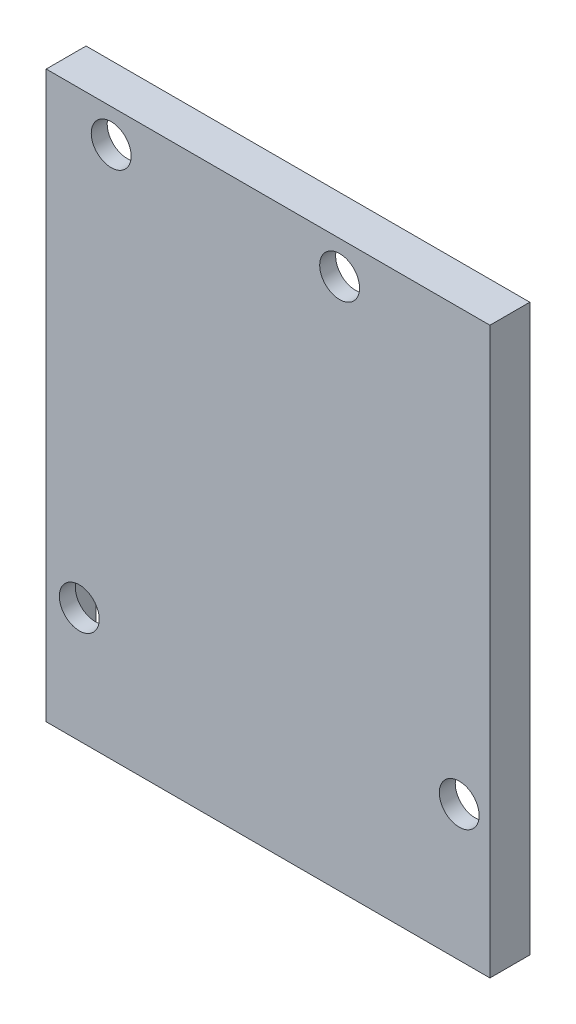
ISO-10303-21;
HEADER;
FILE_DESCRIPTION(('STEP AP214'),'2;1');
FILE_NAME('part.step','',(''),(''),'','','');
FILE_SCHEMA(('AUTOMOTIVE_DESIGN { 1 0 10303 214 1 1 1 1 }'));
ENDSEC;
DATA;
#1=APPLICATION_CONTEXT('core data for automotive mechanical design processes');
#2=APPLICATION_PROTOCOL_DEFINITION('international standard','automotive_design',2000,#1);
#3=PRODUCT_CONTEXT('',#1,'mechanical');
#4=PRODUCT('Part','Part','',(#3));
#5=PRODUCT_RELATED_PRODUCT_CATEGORY('part','',(#4));
#6=PRODUCT_DEFINITION_FORMATION('','',#4);
#7=PRODUCT_DEFINITION_CONTEXT('part definition',#1,'design');
#8=PRODUCT_DEFINITION('design','',#6,#7);
#9=PRODUCT_DEFINITION_SHAPE('','',#8);
#10=(LENGTH_UNIT() NAMED_UNIT(*) SI_UNIT(.MILLI.,.METRE.));
#11=(NAMED_UNIT(*) PLANE_ANGLE_UNIT() SI_UNIT($,.RADIAN.));
#12=(NAMED_UNIT(*) SI_UNIT($,.STERADIAN.) SOLID_ANGLE_UNIT());
#13=UNCERTAINTY_MEASURE_WITH_UNIT(LENGTH_MEASURE(1.E-05),#10,'distance_accuracy_value','');
#14=(GEOMETRIC_REPRESENTATION_CONTEXT(3) GLOBAL_UNCERTAINTY_ASSIGNED_CONTEXT((#13)) GLOBAL_UNIT_ASSIGNED_CONTEXT((#10,
#11,#12)) REPRESENTATION_CONTEXT('',''));
#15=CARTESIAN_POINT('',(0.,0.,0.));
#16=DIRECTION('',(0.,0.,1.));
#17=DIRECTION('',(1.,0.,0.));
#18=AXIS2_PLACEMENT_3D('',#15,#16,#17);
#19=CARTESIAN_POINT('',(0.,0.,0.));
#20=DIRECTION('',(0.,0.,1.));
#21=DIRECTION('',(1.,0.,0.));
#22=AXIS2_PLACEMENT_3D('',#19,#20,#21);
#23=PLANE('',#22);
#24=DIRECTION('',(0.,-1.,0.));
#25=VECTOR('',#24,1.);
#26=CARTESIAN_POINT('',(-27.825,-35.45,0.));
#27=LINE('',#26,#25);
#28=CARTESIAN_POINT('',(-27.825,35.45,0.));
#29=VERTEX_POINT('',#28);
#30=CARTESIAN_POINT('',(-27.825,-35.45,0.));
#31=VERTEX_POINT('',#30);
#32=EDGE_CURVE('E146',#29,#31,#27,.T.);
#33=ORIENTED_EDGE('',*,*,#32,.F.);
#34=DIRECTION('',(-1.,0.,0.));
#35=VECTOR('',#34,1.);
#36=CARTESIAN_POINT('',(27.825,35.45,0.));
#37=LINE('',#36,#35);
#38=CARTESIAN_POINT('',(27.825,35.45,0.));
#39=VERTEX_POINT('',#38);
#40=EDGE_CURVE('E93',#39,#29,#37,.T.);
#41=ORIENTED_EDGE('',*,*,#40,.F.);
#42=DIRECTION('',(0.,1.,0.));
#43=VECTOR('',#42,1.);
#44=CARTESIAN_POINT('',(27.825,-35.45,0.));
#45=LINE('',#44,#43);
#46=CARTESIAN_POINT('',(27.825,-35.45,0.));
#47=VERTEX_POINT('',#46);
#48=EDGE_CURVE('E171',#47,#39,#45,.T.);
#49=ORIENTED_EDGE('',*,*,#48,.F.);
#50=DIRECTION('',(1.,0.,0.));
#51=VECTOR('',#50,1.);
#52=CARTESIAN_POINT('',(27.825,-35.45,0.));
#53=LINE('',#52,#51);
#54=EDGE_CURVE('E152',#31,#47,#53,.T.);
#55=ORIENTED_EDGE('',*,*,#54,.F.);
#56=EDGE_LOOP('',(#33,#41,#49,#55));
#57=FACE_BOUND('',#56,.T.);
#58=DIRECTION('',(1.,0.,0.));
#59=VECTOR('',#58,1.);
#60=CARTESIAN_POINT('',(-26.575,-34.2,0.));
#61=LINE('',#60,#59);
#62=CARTESIAN_POINT('',(-26.575,-34.2,0.));
#63=VERTEX_POINT('',#62);
#64=CARTESIAN_POINT('',(26.575,-34.2,0.));
#65=VERTEX_POINT('',#64);
#66=EDGE_CURVE('E63',#63,#65,#61,.T.);
#67=ORIENTED_EDGE('',*,*,#66,.T.);
#68=DIRECTION('',(0.,1.,0.));
#69=VECTOR('',#68,1.);
#70=CARTESIAN_POINT('',(26.575,-34.2,0.));
#71=LINE('',#70,#69);
#72=CARTESIAN_POINT('',(26.575,34.2,0.));
#73=VERTEX_POINT('',#72);
#74=EDGE_CURVE('E144',#65,#73,#71,.T.);
#75=ORIENTED_EDGE('',*,*,#74,.T.);
#76=DIRECTION('',(1.,0.,0.));
#77=VECTOR('',#76,1.);
#78=CARTESIAN_POINT('',(-26.575,34.2,0.));
#79=LINE('',#78,#77);
#80=CARTESIAN_POINT('',(-26.575,34.2,0.));
#81=VERTEX_POINT('',#80);
#82=EDGE_CURVE('E206',#81,#73,#79,.T.);
#83=ORIENTED_EDGE('',*,*,#82,.F.);
#84=DIRECTION('',(0.,1.,0.));
#85=VECTOR('',#84,1.);
#86=CARTESIAN_POINT('',(-26.575,-34.2,0.));
#87=LINE('',#86,#85);
#88=EDGE_CURVE('E140',#63,#81,#87,.T.);
#89=ORIENTED_EDGE('',*,*,#88,.F.);
#90=EDGE_LOOP('',(#67,#75,#83,#89));
#91=FACE_BOUND('',#90,.T.);
#92=ADVANCED_FACE('F45',(#57,#91),#23,.F.);
#93=CARTESIAN_POINT('',(-27.825,-35.45,5.));
#94=DIRECTION('',(1.,0.,0.));
#95=DIRECTION('',(0.,0.,-1.));
#96=AXIS2_PLACEMENT_3D('',#93,#94,#95);
#97=PLANE('',#96);
#98=ORIENTED_EDGE('',*,*,#32,.T.);
#99=DIRECTION('',(0.,0.,-1.));
#100=VECTOR('',#99,1.);
#101=CARTESIAN_POINT('',(-27.825,-35.45,5.));
#102=LINE('',#101,#100);
#103=CARTESIAN_POINT('',(-27.825,-35.45,5.));
#104=VERTEX_POINT('',#103);
#105=EDGE_CURVE('E11',#104,#31,#102,.T.);
#106=ORIENTED_EDGE('',*,*,#105,.F.);
#107=DIRECTION('',(0.,-1.,0.));
#108=VECTOR('',#107,1.);
#109=CARTESIAN_POINT('',(-27.825,-35.45,5.));
#110=LINE('',#109,#108);
#111=CARTESIAN_POINT('',(-27.825,35.45,5.));
#112=VERTEX_POINT('',#111);
#113=EDGE_CURVE('E158',#112,#104,#110,.T.);
#114=ORIENTED_EDGE('',*,*,#113,.F.);
#115=DIRECTION('',(0.,0.,-1.));
#116=VECTOR('',#115,1.);
#117=CARTESIAN_POINT('',(-27.825,35.45,5.));
#118=LINE('',#117,#116);
#119=EDGE_CURVE('E167',#112,#29,#118,.T.);
#120=ORIENTED_EDGE('',*,*,#119,.T.);
#121=EDGE_LOOP('',(#98,#106,#114,#120));
#122=FACE_BOUND('',#121,.T.);
#123=ADVANCED_FACE('F47',(#122),#97,.F.);
#124=CARTESIAN_POINT('',(27.825,-35.45,5.));
#125=DIRECTION('',(0.,1.,0.));
#126=DIRECTION('',(-1.,0.,0.));
#127=AXIS2_PLACEMENT_3D('',#124,#125,#126);
#128=PLANE('',#127);
#129=ORIENTED_EDGE('',*,*,#54,.T.);
#130=DIRECTION('',(0.,0.,-1.));
#131=VECTOR('',#130,1.);
#132=CARTESIAN_POINT('',(27.825,-35.45,5.));
#133=LINE('',#132,#131);
#134=CARTESIAN_POINT('',(27.825,-35.45,5.));
#135=VERTEX_POINT('',#134);
#136=EDGE_CURVE('E55',#135,#47,#133,.T.);
#137=ORIENTED_EDGE('',*,*,#136,.F.);
#138=DIRECTION('',(1.,0.,0.));
#139=VECTOR('',#138,1.);
#140=CARTESIAN_POINT('',(27.825,-35.45,5.));
#141=LINE('',#140,#139);
#142=EDGE_CURVE('E100',#104,#135,#141,.T.);
#143=ORIENTED_EDGE('',*,*,#142,.F.);
#144=ORIENTED_EDGE('',*,*,#105,.T.);
#145=EDGE_LOOP('',(#129,#137,#143,#144));
#146=FACE_BOUND('',#145,.T.);
#147=ADVANCED_FACE('F233',(#146),#128,.F.);
#148=CARTESIAN_POINT('',(27.825,-35.45,5.));
#149=DIRECTION('',(-1.,0.,0.));
#150=DIRECTION('',(0.,0.,1.));
#151=AXIS2_PLACEMENT_3D('',#148,#149,#150);
#152=PLANE('',#151);
#153=ORIENTED_EDGE('',*,*,#48,.T.);
#154=DIRECTION('',(0.,0.,-1.));
#155=VECTOR('',#154,1.);
#156=CARTESIAN_POINT('',(27.825,35.45,5.));
#157=LINE('',#156,#155);
#158=CARTESIAN_POINT('',(27.825,35.45,5.));
#159=VERTEX_POINT('',#158);
#160=EDGE_CURVE('E178',#159,#39,#157,.T.);
#161=ORIENTED_EDGE('',*,*,#160,.F.);
#162=DIRECTION('',(0.,1.,0.));
#163=VECTOR('',#162,1.);
#164=CARTESIAN_POINT('',(27.825,-35.45,5.));
#165=LINE('',#164,#163);
#166=EDGE_CURVE('E163',#135,#159,#165,.T.);
#167=ORIENTED_EDGE('',*,*,#166,.F.);
#168=ORIENTED_EDGE('',*,*,#136,.T.);
#169=EDGE_LOOP('',(#153,#161,#167,#168));
#170=FACE_BOUND('',#169,.T.);
#171=ADVANCED_FACE('F242',(#170),#152,.F.);
#172=CARTESIAN_POINT('',(27.825,35.45,5.));
#173=DIRECTION('',(0.,-1.,0.));
#174=DIRECTION('',(1.,0.,0.));
#175=AXIS2_PLACEMENT_3D('',#172,#173,#174);
#176=PLANE('',#175);
#177=ORIENTED_EDGE('',*,*,#40,.T.);
#178=ORIENTED_EDGE('',*,*,#119,.F.);
#179=DIRECTION('',(-1.,0.,0.));
#180=VECTOR('',#179,1.);
#181=CARTESIAN_POINT('',(27.825,35.45,5.));
#182=LINE('',#181,#180);
#183=EDGE_CURVE('E72',#159,#112,#182,.T.);
#184=ORIENTED_EDGE('',*,*,#183,.F.);
#185=ORIENTED_EDGE('',*,*,#160,.T.);
#186=EDGE_LOOP('',(#177,#178,#184,#185));
#187=FACE_BOUND('',#186,.T.);
#188=ADVANCED_FACE('F240',(#187),#176,.F.);
#189=CARTESIAN_POINT('',(0.,0.,5.));
#190=DIRECTION('',(0.,0.,1.));
#191=DIRECTION('',(1.,0.,0.));
#192=AXIS2_PLACEMENT_3D('',#189,#190,#191);
#193=PLANE('',#192);
#194=CARTESIAN_POINT('',(23.9734703408036,-18.4918327574256,5.));
#195=DIRECTION('',(0.,0.,-1.));
#196=DIRECTION('',(-1.,0.,0.));
#197=AXIS2_PLACEMENT_3D('',#194,#195,#196);
#198=CIRCLE('',#197,2.5);
#199=CARTESIAN_POINT('',(21.4734703408036,-18.4918327574256,5.));
#200=VERTEX_POINT('',#199);
#201=EDGE_CURVE('E189',#200,#200,#198,.T.);
#202=ORIENTED_EDGE('',*,*,#201,.T.);
#203=EDGE_LOOP('',(#202));
#204=FACE_BOUND('',#203,.T.);
#205=CARTESIAN_POINT('',(-23.6765296591964,-20.9918327574256,5.));
#206=DIRECTION('',(0.,0.,-1.));
#207=DIRECTION('',(-1.,0.,0.));
#208=AXIS2_PLACEMENT_3D('',#205,#206,#207);
#209=CIRCLE('',#208,2.49999999999999);
#210=CARTESIAN_POINT('',(-26.1765296591964,-20.9918327574256,5.));
#211=VERTEX_POINT('',#210);
#212=EDGE_CURVE('E265',#211,#211,#209,.T.);
#213=ORIENTED_EDGE('',*,*,#212,.T.);
#214=EDGE_LOOP('',(#213));
#215=FACE_BOUND('',#214,.T.);
#216=CARTESIAN_POINT('',(-19.6765296591964,31.3081672425744,5.));
#217=DIRECTION('',(0.,0.,-1.));
#218=DIRECTION('',(-1.,0.,0.));
#219=AXIS2_PLACEMENT_3D('',#216,#217,#218);
#220=CIRCLE('',#219,2.5);
#221=CARTESIAN_POINT('',(-22.1765296591964,31.3081672425744,5.));
#222=VERTEX_POINT('',#221);
#223=EDGE_CURVE('E269',#222,#222,#220,.T.);
#224=ORIENTED_EDGE('',*,*,#223,.T.);
#225=EDGE_LOOP('',(#224));
#226=FACE_BOUND('',#225,.T.);
#227=CARTESIAN_POINT('',(8.97347034080361,31.3081672425744,5.));
#228=DIRECTION('',(0.,0.,-1.));
#229=DIRECTION('',(-1.,0.,0.));
#230=AXIS2_PLACEMENT_3D('',#227,#228,#229);
#231=CIRCLE('',#230,2.5);
#232=CARTESIAN_POINT('',(6.47347034080361,31.3081672425744,5.));
#233=VERTEX_POINT('',#232);
#234=EDGE_CURVE('E272',#233,#233,#231,.T.);
#235=ORIENTED_EDGE('',*,*,#234,.T.);
#236=EDGE_LOOP('',(#235));
#237=FACE_BOUND('',#236,.T.);
#238=ORIENTED_EDGE('',*,*,#113,.T.);
#239=ORIENTED_EDGE('',*,*,#142,.T.);
#240=ORIENTED_EDGE('',*,*,#166,.T.);
#241=ORIENTED_EDGE('',*,*,#183,.T.);
#242=EDGE_LOOP('',(#238,#239,#240,#241));
#243=FACE_BOUND('',#242,.T.);
#244=ADVANCED_FACE('F238',(#204,#215,#226,#237,#243),#193,.T.);
#245=CARTESIAN_POINT('',(-26.575,-34.2,3.));
#246=DIRECTION('',(0.,1.,0.));
#247=DIRECTION('',(0.,0.,1.));
#248=AXIS2_PLACEMENT_3D('',#245,#246,#247);
#249=PLANE('',#248);
#250=ORIENTED_EDGE('',*,*,#66,.F.);
#251=DIRECTION('',(0.,0.,-1.));
#252=VECTOR('',#251,1.);
#253=CARTESIAN_POINT('',(-26.575,-34.2,3.));
#254=LINE('',#253,#252);
#255=CARTESIAN_POINT('',(-26.575,-34.2,3.));
#256=VERTEX_POINT('',#255);
#257=EDGE_CURVE('E138',#256,#63,#254,.T.);
#258=ORIENTED_EDGE('',*,*,#257,.F.);
#259=DIRECTION('',(1.,0.,0.));
#260=VECTOR('',#259,1.);
#261=CARTESIAN_POINT('',(-26.575,-34.2,3.));
#262=LINE('',#261,#260);
#263=CARTESIAN_POINT('',(26.575,-34.2,3.));
#264=VERTEX_POINT('',#263);
#265=EDGE_CURVE('E127',#256,#264,#262,.T.);
#266=ORIENTED_EDGE('',*,*,#265,.T.);
#267=DIRECTION('',(0.,0.,-1.));
#268=VECTOR('',#267,1.);
#269=CARTESIAN_POINT('',(26.575,-34.2,3.));
#270=LINE('',#269,#268);
#271=EDGE_CURVE('E137',#264,#65,#270,.T.);
#272=ORIENTED_EDGE('',*,*,#271,.T.);
#273=EDGE_LOOP('',(#250,#258,#266,#272));
#274=FACE_BOUND('',#273,.T.);
#275=ADVANCED_FACE('F136',(#274),#249,.T.);
#276=CARTESIAN_POINT('',(26.575,-34.2,3.));
#277=DIRECTION('',(-1.,0.,0.));
#278=DIRECTION('',(0.,0.,1.));
#279=AXIS2_PLACEMENT_3D('',#276,#277,#278);
#280=PLANE('',#279);
#281=ORIENTED_EDGE('',*,*,#74,.F.);
#282=ORIENTED_EDGE('',*,*,#271,.F.);
#283=DIRECTION('',(0.,1.,0.));
#284=VECTOR('',#283,1.);
#285=CARTESIAN_POINT('',(26.575,-34.2,3.));
#286=LINE('',#285,#284);
#287=CARTESIAN_POINT('',(26.575,34.2,3.));
#288=VERTEX_POINT('',#287);
#289=EDGE_CURVE('E123',#264,#288,#286,.T.);
#290=ORIENTED_EDGE('',*,*,#289,.T.);
#291=DIRECTION('',(0.,0.,-1.));
#292=VECTOR('',#291,1.);
#293=CARTESIAN_POINT('',(26.575,34.2,3.));
#294=LINE('',#293,#292);
#295=EDGE_CURVE('E147',#288,#73,#294,.T.);
#296=ORIENTED_EDGE('',*,*,#295,.T.);
#297=EDGE_LOOP('',(#281,#282,#290,#296));
#298=FACE_BOUND('',#297,.T.);
#299=ADVANCED_FACE('F142',(#298),#280,.T.);
#300=CARTESIAN_POINT('',(-26.575,34.2,3.));
#301=DIRECTION('',(0.,1.,0.));
#302=DIRECTION('',(0.,0.,1.));
#303=AXIS2_PLACEMENT_3D('',#300,#301,#302);
#304=PLANE('',#303);
#305=ORIENTED_EDGE('',*,*,#82,.T.);
#306=ORIENTED_EDGE('',*,*,#295,.F.);
#307=DIRECTION('',(1.,0.,0.));
#308=VECTOR('',#307,1.);
#309=CARTESIAN_POINT('',(-26.575,34.2,3.));
#310=LINE('',#309,#308);
#311=CARTESIAN_POINT('',(-26.575,34.2,3.));
#312=VERTEX_POINT('',#311);
#313=EDGE_CURVE('E130',#312,#288,#310,.T.);
#314=ORIENTED_EDGE('',*,*,#313,.F.);
#315=DIRECTION('',(0.,0.,-1.));
#316=VECTOR('',#315,1.);
#317=CARTESIAN_POINT('',(-26.575,34.2,3.));
#318=LINE('',#317,#316);
#319=EDGE_CURVE('E154',#312,#81,#318,.T.);
#320=ORIENTED_EDGE('',*,*,#319,.T.);
#321=EDGE_LOOP('',(#305,#306,#314,#320));
#322=FACE_BOUND('',#321,.T.);
#323=ADVANCED_FACE('F221',(#322),#304,.F.);
#324=CARTESIAN_POINT('',(-26.575,-34.2,3.));
#325=DIRECTION('',(-1.,0.,0.));
#326=DIRECTION('',(0.,0.,1.));
#327=AXIS2_PLACEMENT_3D('',#324,#325,#326);
#328=PLANE('',#327);
#329=ORIENTED_EDGE('',*,*,#88,.T.);
#330=ORIENTED_EDGE('',*,*,#319,.F.);
#331=DIRECTION('',(0.,1.,0.));
#332=VECTOR('',#331,1.);
#333=CARTESIAN_POINT('',(-26.575,-34.2,3.));
#334=LINE('',#333,#332);
#335=EDGE_CURVE('E209',#256,#312,#334,.T.);
#336=ORIENTED_EDGE('',*,*,#335,.F.);
#337=ORIENTED_EDGE('',*,*,#257,.T.);
#338=EDGE_LOOP('',(#329,#330,#336,#337));
#339=FACE_BOUND('',#338,.T.);
#340=ADVANCED_FACE('F224',(#339),#328,.F.);
#341=CARTESIAN_POINT('',(0.,0.,3.));
#342=DIRECTION('',(0.,0.,1.));
#343=DIRECTION('',(1.,0.,0.));
#344=AXIS2_PLACEMENT_3D('',#341,#342,#343);
#345=PLANE('',#344);
#346=CARTESIAN_POINT('',(23.9734703408036,-18.4918327574256,3.));
#347=DIRECTION('',(0.,0.,1.));
#348=DIRECTION('',(1.,0.,0.));
#349=AXIS2_PLACEMENT_3D('',#346,#347,#348);
#350=CIRCLE('',#349,2.5);
#351=CARTESIAN_POINT('',(26.4734703408036,-18.4918327574256,3.));
#352=VERTEX_POINT('',#351);
#353=EDGE_CURVE('E49',#352,#352,#350,.T.);
#354=ORIENTED_EDGE('',*,*,#353,.T.);
#355=EDGE_LOOP('',(#354));
#356=FACE_BOUND('',#355,.T.);
#357=CARTESIAN_POINT('',(-23.6765296591964,-20.9918327574256,3.));
#358=DIRECTION('',(0.,0.,1.));
#359=DIRECTION('',(1.,0.,0.));
#360=AXIS2_PLACEMENT_3D('',#357,#358,#359);
#361=CIRCLE('',#360,2.49999999999999);
#362=CARTESIAN_POINT('',(-21.1765296591964,-20.9918327574256,3.));
#363=VERTEX_POINT('',#362);
#364=EDGE_CURVE('E192',#363,#363,#361,.T.);
#365=ORIENTED_EDGE('',*,*,#364,.T.);
#366=EDGE_LOOP('',(#365));
#367=FACE_BOUND('',#366,.T.);
#368=CARTESIAN_POINT('',(-19.6765296591964,31.3081672425744,3.));
#369=DIRECTION('',(0.,0.,1.));
#370=DIRECTION('',(1.,0.,0.));
#371=AXIS2_PLACEMENT_3D('',#368,#369,#370);
#372=CIRCLE('',#371,2.5);
#373=CARTESIAN_POINT('',(-17.1765296591964,31.3081672425744,3.));
#374=VERTEX_POINT('',#373);
#375=EDGE_CURVE('E188',#374,#374,#372,.T.);
#376=ORIENTED_EDGE('',*,*,#375,.T.);
#377=EDGE_LOOP('',(#376));
#378=FACE_BOUND('',#377,.T.);
#379=CARTESIAN_POINT('',(8.97347034080361,31.3081672425744,3.));
#380=DIRECTION('',(0.,0.,1.));
#381=DIRECTION('',(1.,0.,0.));
#382=AXIS2_PLACEMENT_3D('',#379,#380,#381);
#383=CIRCLE('',#382,2.5);
#384=CARTESIAN_POINT('',(11.4734703408036,31.3081672425744,3.));
#385=VERTEX_POINT('',#384);
#386=EDGE_CURVE('E184',#385,#385,#383,.T.);
#387=ORIENTED_EDGE('',*,*,#386,.T.);
#388=EDGE_LOOP('',(#387));
#389=FACE_BOUND('',#388,.T.);
#390=ORIENTED_EDGE('',*,*,#265,.F.);
#391=ORIENTED_EDGE('',*,*,#335,.T.);
#392=ORIENTED_EDGE('',*,*,#313,.T.);
#393=ORIENTED_EDGE('',*,*,#289,.F.);
#394=EDGE_LOOP('',(#390,#391,#392,#393));
#395=FACE_BOUND('',#394,.T.);
#396=ADVANCED_FACE('F125',(#356,#367,#378,#389,#395),#345,.F.);
#397=CARTESIAN_POINT('',(8.97347034080361,31.3081672425744,5.));
#398=DIRECTION('',(0.,0.,-1.));
#399=DIRECTION('',(-1.,0.,0.));
#400=AXIS2_PLACEMENT_3D('',#397,#398,#399);
#401=CYLINDRICAL_SURFACE('',#400,2.5);
#402=ORIENTED_EDGE('',*,*,#234,.F.);
#403=EDGE_LOOP('',(#402));
#404=FACE_BOUND('',#403,.T.);
#405=ORIENTED_EDGE('',*,*,#386,.F.);
#406=EDGE_LOOP('',(#405));
#407=FACE_BOUND('',#406,.T.);
#408=ADVANCED_FACE('F284',(#404,#407),#401,.F.);
#409=CARTESIAN_POINT('',(-19.6765296591964,31.3081672425744,5.));
#410=DIRECTION('',(0.,0.,-1.));
#411=DIRECTION('',(-1.,0.,0.));
#412=AXIS2_PLACEMENT_3D('',#409,#410,#411);
#413=CYLINDRICAL_SURFACE('',#412,2.5);
#414=ORIENTED_EDGE('',*,*,#223,.F.);
#415=EDGE_LOOP('',(#414));
#416=FACE_BOUND('',#415,.T.);
#417=ORIENTED_EDGE('',*,*,#375,.F.);
#418=EDGE_LOOP('',(#417));
#419=FACE_BOUND('',#418,.T.);
#420=ADVANCED_FACE('F287',(#416,#419),#413,.F.);
#421=CARTESIAN_POINT('',(-23.6765296591964,-20.9918327574256,5.));
#422=DIRECTION('',(0.,0.,-1.));
#423=DIRECTION('',(-1.,0.,0.));
#424=AXIS2_PLACEMENT_3D('',#421,#422,#423);
#425=CYLINDRICAL_SURFACE('',#424,2.49999999999999);
#426=ORIENTED_EDGE('',*,*,#212,.F.);
#427=EDGE_LOOP('',(#426));
#428=FACE_BOUND('',#427,.T.);
#429=ORIENTED_EDGE('',*,*,#364,.F.);
#430=EDGE_LOOP('',(#429));
#431=FACE_BOUND('',#430,.T.);
#432=ADVANCED_FACE('F334',(#428,#431),#425,.F.);
#433=CARTESIAN_POINT('',(23.9734703408036,-18.4918327574256,5.));
#434=DIRECTION('',(0.,0.,-1.));
#435=DIRECTION('',(-1.,0.,0.));
#436=AXIS2_PLACEMENT_3D('',#433,#434,#435);
#437=CYLINDRICAL_SURFACE('',#436,2.5);
#438=ORIENTED_EDGE('',*,*,#201,.F.);
#439=EDGE_LOOP('',(#438));
#440=FACE_BOUND('',#439,.T.);
#441=ORIENTED_EDGE('',*,*,#353,.F.);
#442=EDGE_LOOP('',(#441));
#443=FACE_BOUND('',#442,.T.);
#444=ADVANCED_FACE('F343',(#440,#443),#437,.F.);
#445=CLOSED_SHELL('',(#92,#123,#147,#171,#188,#244,#275,#299,#323,#340,#396,#408,#420,#432,#444));
#446=MANIFOLD_SOLID_BREP('B2',#445);
#447=ADVANCED_BREP_SHAPE_REPRESENTATION('',(#18,#446),#14);
#448=SHAPE_DEFINITION_REPRESENTATION(#9,#447);
ENDSEC;
END-ISO-10303-21;
